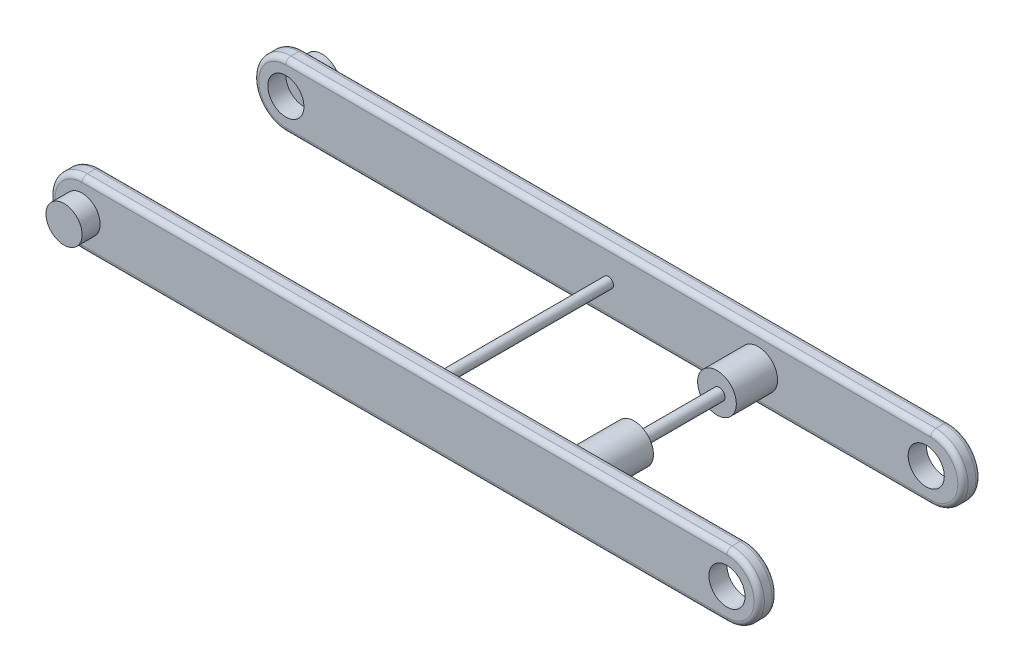
ISO-10303-21;
HEADER;
FILE_DESCRIPTION(('STEP AP214'),'2;1');
FILE_NAME('part.step','',(''),(''),'','','');
FILE_SCHEMA(('AUTOMOTIVE_DESIGN { 1 0 10303 214 1 1 1 1 }'));
ENDSEC;
DATA;
#1=APPLICATION_CONTEXT('core data for automotive mechanical design processes');
#2=APPLICATION_PROTOCOL_DEFINITION('international standard','automotive_design',2000,#1);
#3=PRODUCT_CONTEXT('',#1,'mechanical');
#4=PRODUCT('Part','Part','',(#3));
#5=PRODUCT_RELATED_PRODUCT_CATEGORY('part','',(#4));
#6=PRODUCT_DEFINITION_FORMATION('','',#4);
#7=PRODUCT_DEFINITION_CONTEXT('part definition',#1,'design');
#8=PRODUCT_DEFINITION('design','',#6,#7);
#9=PRODUCT_DEFINITION_SHAPE('','',#8);
#10=(LENGTH_UNIT() NAMED_UNIT(*) SI_UNIT(.MILLI.,.METRE.));
#11=(NAMED_UNIT(*) PLANE_ANGLE_UNIT() SI_UNIT($,.RADIAN.));
#12=(NAMED_UNIT(*) SI_UNIT($,.STERADIAN.) SOLID_ANGLE_UNIT());
#13=UNCERTAINTY_MEASURE_WITH_UNIT(LENGTH_MEASURE(1.E-05),#10,'distance_accuracy_value','');
#14=(GEOMETRIC_REPRESENTATION_CONTEXT(3) GLOBAL_UNCERTAINTY_ASSIGNED_CONTEXT((#13)) GLOBAL_UNIT_ASSIGNED_CONTEXT((#10,
#11,#12)) REPRESENTATION_CONTEXT('',''));
#15=CARTESIAN_POINT('',(0.,0.,0.));
#16=DIRECTION('',(0.,0.,1.));
#17=DIRECTION('',(1.,0.,0.));
#18=AXIS2_PLACEMENT_3D('',#15,#16,#17);
#19=CARTESIAN_POINT('',(-125.,0.,93.));
#20=DIRECTION('',(0.,0.,-1.));
#21=DIRECTION('',(-1.,0.,0.));
#22=AXIS2_PLACEMENT_3D('',#19,#20,#21);
#23=CYLINDRICAL_SURFACE('',#22,7.00000000000001);
#24=CARTESIAN_POINT('',(-125.,0.,93.));
#25=DIRECTION('',(0.,0.,1.));
#26=DIRECTION('',(1.,0.,0.));
#27=AXIS2_PLACEMENT_3D('',#24,#25,#26);
#28=CIRCLE('',#27,7.00000000000001);
#29=CARTESIAN_POINT('',(-118.,0.,93.));
#30=VERTEX_POINT('',#29);
#31=EDGE_CURVE('E11',#30,#30,#28,.T.);
#32=ORIENTED_EDGE('',*,*,#31,.F.);
#33=EDGE_LOOP('',(#32));
#34=FACE_BOUND('',#33,.T.);
#35=CARTESIAN_POINT('',(-125.,0.,86.));
#36=DIRECTION('',(0.,0.,1.));
#37=DIRECTION('',(1.,0.,0.));
#38=AXIS2_PLACEMENT_3D('',#35,#36,#37);
#39=CIRCLE('',#38,7.00000000000001);
#40=CARTESIAN_POINT('',(-118.,0.,86.));
#41=VERTEX_POINT('',#40);
#42=EDGE_CURVE('E43',#41,#41,#39,.T.);
#43=ORIENTED_EDGE('',*,*,#42,.T.);
#44=EDGE_LOOP('',(#43));
#45=FACE_BOUND('',#44,.T.);
#46=ADVANCED_FACE('F40',(#34,#45),#23,.T.);
#47=CARTESIAN_POINT('',(-125.,0.,93.));
#48=DIRECTION('',(0.,0.,1.));
#49=DIRECTION('',(1.,0.,0.));
#50=AXIS2_PLACEMENT_3D('',#47,#48,#49);
#51=PLANE('',#50);
#52=ORIENTED_EDGE('',*,*,#31,.T.);
#53=EDGE_LOOP('',(#52));
#54=FACE_BOUND('',#53,.T.);
#55=ADVANCED_FACE('F55',(#54),#51,.T.);
#56=CARTESIAN_POINT('',(-125.,0.,86.));
#57=DIRECTION('',(0.,0.,1.));
#58=DIRECTION('',(1.,0.,0.));
#59=AXIS2_PLACEMENT_3D('',#56,#57,#58);
#60=PLANE('',#59);
#61=ORIENTED_EDGE('',*,*,#42,.F.);
#62=EDGE_LOOP('',(#61));
#63=FACE_BOUND('',#62,.T.);
#64=ADVANCED_FACE('F53',(#63),#60,.F.);
#65=CLOSED_SHELL('',(#46,#55,#64));
#66=MANIFOLD_SOLID_BREP('B2',#65);
#67=CARTESIAN_POINT('',(59.,0.,82.));
#68=DIRECTION('',(0.,0.,-1.));
#69=DIRECTION('',(-1.,0.,0.));
#70=AXIS2_PLACEMENT_3D('',#67,#68,#69);
#71=CYLINDRICAL_SURFACE('',#70,2.25);
#72=CARTESIAN_POINT('',(59.,0.,56.));
#73=DIRECTION('',(0.,0.,-1.));
#74=DIRECTION('',(-1.,0.,0.));
#75=AXIS2_PLACEMENT_3D('',#72,#73,#74);
#76=CIRCLE('',#75,2.25);
#77=CARTESIAN_POINT('',(56.75,0.,56.));
#78=VERTEX_POINT('',#77);
#79=EDGE_CURVE('E38',#78,#78,#76,.F.);
#80=ORIENTED_EDGE('',*,*,#79,.F.);
#81=EDGE_LOOP('',(#80));
#82=FACE_BOUND('',#81,.T.);
#83=CARTESIAN_POINT('',(59.,0.,23.));
#84=DIRECTION('',(0.,0.,-1.));
#85=DIRECTION('',(-1.,0.,0.));
#86=AXIS2_PLACEMENT_3D('',#83,#84,#85);
#87=CIRCLE('',#86,2.25);
#88=CARTESIAN_POINT('',(56.75,0.,23.));
#89=VERTEX_POINT('',#88);
#90=EDGE_CURVE('E263',#89,#89,#87,.F.);
#91=ORIENTED_EDGE('',*,*,#90,.T.);
#92=EDGE_LOOP('',(#91));
#93=FACE_BOUND('',#92,.T.);
#94=ADVANCED_FACE('F81',(#82,#93),#71,.T.);
#95=CARTESIAN_POINT('',(125.,0.,86.));
#96=DIRECTION('',(0.,0.,-1.));
#97=DIRECTION('',(-1.,0.,0.));
#98=AXIS2_PLACEMENT_3D('',#95,#96,#97);
#99=CYLINDRICAL_SURFACE('',#98,12.5);
#100=DIRECTION('',(0.,0.,-1.));
#101=VECTOR('',#100,1.);
#102=CARTESIAN_POINT('',(125.,12.5,86.));
#103=LINE('',#102,#101);
#104=CARTESIAN_POINT('',(125.,12.5,84.));
#105=VERTEX_POINT('',#104);
#106=CARTESIAN_POINT('',(125.,12.5,81.));
#107=VERTEX_POINT('',#106);
#108=EDGE_CURVE('E292',#105,#107,#103,.T.);
#109=ORIENTED_EDGE('',*,*,#108,.F.);
#110=CARTESIAN_POINT('',(125.,0.,84.));
#111=DIRECTION('',(0.,0.,1.));
#112=DIRECTION('',(1.,0.,0.));
#113=AXIS2_PLACEMENT_3D('',#110,#111,#112);
#114=CIRCLE('',#113,12.5);
#115=CARTESIAN_POINT('',(125.,-12.5,84.));
#116=VERTEX_POINT('',#115);
#117=EDGE_CURVE('E316',#105,#116,#114,.F.);
#118=ORIENTED_EDGE('',*,*,#117,.T.);
#119=DIRECTION('',(0.,0.,-1.));
#120=VECTOR('',#119,1.);
#121=CARTESIAN_POINT('',(125.,-12.5,86.));
#122=LINE('',#121,#120);
#123=CARTESIAN_POINT('',(125.,-12.5,81.));
#124=VERTEX_POINT('',#123);
#125=EDGE_CURVE('E273',#116,#124,#122,.T.);
#126=ORIENTED_EDGE('',*,*,#125,.T.);
#127=CARTESIAN_POINT('',(125.,0.,81.));
#128=DIRECTION('',(0.,0.,1.));
#129=DIRECTION('',(1.,0.,0.));
#130=AXIS2_PLACEMENT_3D('',#127,#128,#129);
#131=CIRCLE('',#130,12.5);
#132=EDGE_CURVE('E313',#124,#107,#131,.T.);
#133=ORIENTED_EDGE('',*,*,#132,.T.);
#134=EDGE_LOOP('',(#109,#118,#126,#133));
#135=FACE_BOUND('',#134,.T.);
#136=ADVANCED_FACE('F462',(#135),#99,.T.);
#137=CARTESIAN_POINT('',(125.,12.5,86.));
#138=DIRECTION('',(0.,-1.,0.));
#139=DIRECTION('',(1.,0.,0.));
#140=AXIS2_PLACEMENT_3D('',#137,#138,#139);
#141=PLANE('',#140);
#142=DIRECTION('',(0.,0.,-1.));
#143=VECTOR('',#142,1.);
#144=CARTESIAN_POINT('',(-125.,12.5,86.));
#145=LINE('',#144,#143);
#146=CARTESIAN_POINT('',(-125.,12.5,84.));
#147=VERTEX_POINT('',#146);
#148=CARTESIAN_POINT('',(-125.,12.5,81.));
#149=VERTEX_POINT('',#148);
#150=EDGE_CURVE('E289',#147,#149,#145,.T.);
#151=ORIENTED_EDGE('',*,*,#150,.F.);
#152=DIRECTION('',(-1.,0.,0.));
#153=VECTOR('',#152,1.);
#154=CARTESIAN_POINT('',(125.,12.5,84.));
#155=LINE('',#154,#153);
#156=EDGE_CURVE('E311',#147,#105,#155,.F.);
#157=ORIENTED_EDGE('',*,*,#156,.T.);
#158=ORIENTED_EDGE('',*,*,#108,.T.);
#159=DIRECTION('',(-1.,0.,0.));
#160=VECTOR('',#159,1.);
#161=CARTESIAN_POINT('',(125.,12.5,81.));
#162=LINE('',#161,#160);
#163=EDGE_CURVE('E309',#107,#149,#162,.T.);
#164=ORIENTED_EDGE('',*,*,#163,.T.);
#165=EDGE_LOOP('',(#151,#157,#158,#164));
#166=FACE_BOUND('',#165,.T.);
#167=ADVANCED_FACE('F470',(#166),#141,.F.);
#168=CARTESIAN_POINT('',(-125.,0.,86.));
#169=DIRECTION('',(0.,0.,-1.));
#170=DIRECTION('',(-1.,0.,0.));
#171=AXIS2_PLACEMENT_3D('',#168,#169,#170);
#172=CYLINDRICAL_SURFACE('',#171,12.5);
#173=DIRECTION('',(0.,0.,-1.));
#174=VECTOR('',#173,1.);
#175=CARTESIAN_POINT('',(-125.,-12.5000000000001,86.));
#176=LINE('',#175,#174);
#177=CARTESIAN_POINT('',(-125.,-12.5000000000001,84.));
#178=VERTEX_POINT('',#177);
#179=CARTESIAN_POINT('',(-125.,-12.5000000000001,81.));
#180=VERTEX_POINT('',#179);
#181=EDGE_CURVE('E286',#178,#180,#176,.T.);
#182=ORIENTED_EDGE('',*,*,#181,.F.);
#183=CARTESIAN_POINT('',(-125.,0.,84.));
#184=DIRECTION('',(0.,0.,1.));
#185=DIRECTION('',(1.,0.,0.));
#186=AXIS2_PLACEMENT_3D('',#183,#184,#185);
#187=CIRCLE('',#186,12.5);
#188=EDGE_CURVE('E306',#178,#147,#187,.F.);
#189=ORIENTED_EDGE('',*,*,#188,.T.);
#190=ORIENTED_EDGE('',*,*,#150,.T.);
#191=CARTESIAN_POINT('',(-125.,0.,81.));
#192=DIRECTION('',(0.,0.,1.));
#193=DIRECTION('',(1.,0.,0.));
#194=AXIS2_PLACEMENT_3D('',#191,#192,#193);
#195=CIRCLE('',#194,12.5);
#196=EDGE_CURVE('E304',#149,#180,#195,.T.);
#197=ORIENTED_EDGE('',*,*,#196,.T.);
#198=EDGE_LOOP('',(#182,#189,#190,#197));
#199=FACE_BOUND('',#198,.T.);
#200=ADVANCED_FACE('F784',(#199),#172,.T.);
#201=CARTESIAN_POINT('',(125.,-12.5,86.));
#202=DIRECTION('',(0.,1.,0.));
#203=DIRECTION('',(-1.,0.,0.));
#204=AXIS2_PLACEMENT_3D('',#201,#202,#203);
#205=PLANE('',#204);
#206=ORIENTED_EDGE('',*,*,#181,.T.);
#207=DIRECTION('',(1.,0.,0.));
#208=VECTOR('',#207,1.);
#209=CARTESIAN_POINT('',(125.,-12.5,81.));
#210=LINE('',#209,#208);
#211=EDGE_CURVE('E327',#180,#124,#210,.T.);
#212=ORIENTED_EDGE('',*,*,#211,.T.);
#213=ORIENTED_EDGE('',*,*,#125,.F.);
#214=DIRECTION('',(1.,0.,0.));
#215=VECTOR('',#214,1.);
#216=CARTESIAN_POINT('',(-125.,-12.5000000000001,84.));
#217=LINE('',#216,#215);
#218=EDGE_CURVE('E325',#116,#178,#217,.F.);
#219=ORIENTED_EDGE('',*,*,#218,.T.);
#220=EDGE_LOOP('',(#206,#212,#213,#219));
#221=FACE_BOUND('',#220,.T.);
#222=ADVANCED_FACE('F780',(#221),#205,.F.);
#223=CARTESIAN_POINT('',(125.,0.,86.));
#224=DIRECTION('',(0.,0.,1.));
#225=DIRECTION('',(1.,0.,0.));
#226=AXIS2_PLACEMENT_3D('',#223,#224,#225);
#227=PLANE('',#226);
#228=DIRECTION('',(-1.,0.,0.));
#229=VECTOR('',#228,1.);
#230=CARTESIAN_POINT('',(-125.,10.4999999999999,86.));
#231=LINE('',#230,#229);
#232=CARTESIAN_POINT('',(125.,10.5,86.));
#233=VERTEX_POINT('',#232);
#234=CARTESIAN_POINT('',(-125.,10.4999999999999,86.));
#235=VERTEX_POINT('',#234);
#236=EDGE_CURVE('E299',#233,#235,#231,.T.);
#237=ORIENTED_EDGE('',*,*,#236,.T.);
#238=CARTESIAN_POINT('',(-125.,0.,86.));
#239=DIRECTION('',(0.,0.,1.));
#240=DIRECTION('',(1.,0.,0.));
#241=AXIS2_PLACEMENT_3D('',#238,#239,#240);
#242=CIRCLE('',#241,10.5);
#243=CARTESIAN_POINT('',(-125.,-10.5000000000001,86.));
#244=VERTEX_POINT('',#243);
#245=EDGE_CURVE('E301',#235,#244,#242,.T.);
#246=ORIENTED_EDGE('',*,*,#245,.T.);
#247=DIRECTION('',(1.,0.,0.));
#248=VECTOR('',#247,1.);
#249=CARTESIAN_POINT('',(125.,-10.5,86.));
#250=LINE('',#249,#248);
#251=CARTESIAN_POINT('',(125.,-10.5,86.));
#252=VERTEX_POINT('',#251);
#253=EDGE_CURVE('E295',#244,#252,#250,.T.);
#254=ORIENTED_EDGE('',*,*,#253,.T.);
#255=CARTESIAN_POINT('',(125.,0.,86.));
#256=DIRECTION('',(0.,0.,1.));
#257=DIRECTION('',(1.,0.,0.));
#258=AXIS2_PLACEMENT_3D('',#255,#256,#257);
#259=CIRCLE('',#258,10.5);
#260=EDGE_CURVE('E297',#252,#233,#259,.T.);
#261=ORIENTED_EDGE('',*,*,#260,.T.);
#262=EDGE_LOOP('',(#237,#246,#254,#261));
#263=FACE_BOUND('',#262,.T.);
#264=CARTESIAN_POINT('',(125.,0.,86.));
#265=DIRECTION('',(0.,0.,1.));
#266=DIRECTION('',(1.,0.,0.));
#267=AXIS2_PLACEMENT_3D('',#264,#265,#266);
#268=CIRCLE('',#267,7.00000000000001);
#269=CARTESIAN_POINT('',(132.,0.,86.));
#270=VERTEX_POINT('',#269);
#271=EDGE_CURVE('E274',#270,#270,#268,.T.);
#272=ORIENTED_EDGE('',*,*,#271,.F.);
#273=EDGE_LOOP('',(#272));
#274=FACE_BOUND('',#273,.T.);
#275=CARTESIAN_POINT('',(-125.,0.,86.));
#276=DIRECTION('',(0.,0.,1.));
#277=DIRECTION('',(1.,0.,0.));
#278=AXIS2_PLACEMENT_3D('',#275,#276,#277);
#279=CIRCLE('',#278,7.);
#280=CARTESIAN_POINT('',(-118.,0.,86.));
#281=VERTEX_POINT('',#280);
#282=EDGE_CURVE('E280',#281,#281,#279,.T.);
#283=ORIENTED_EDGE('',*,*,#282,.F.);
#284=EDGE_LOOP('',(#283));
#285=FACE_BOUND('',#284,.T.);
#286=ADVANCED_FACE('F600',(#263,#274,#285),#227,.T.);
#287=CARTESIAN_POINT('',(125.,0.,79.));
#288=DIRECTION('',(0.,0.,1.));
#289=DIRECTION('',(1.,0.,0.));
#290=AXIS2_PLACEMENT_3D('',#287,#288,#289);
#291=PLANE('',#290);
#292=CARTESIAN_POINT('',(59.,0.,79.));
#293=DIRECTION('',(0.,0.,1.));
#294=DIRECTION('',(1.,0.,0.));
#295=AXIS2_PLACEMENT_3D('',#292,#293,#294);
#296=CIRCLE('',#295,7.5);
#297=CARTESIAN_POINT('',(66.5,0.,79.));
#298=VERTEX_POINT('',#297);
#299=EDGE_CURVE('E89',#298,#298,#296,.F.);
#300=ORIENTED_EDGE('',*,*,#299,.F.);
#301=EDGE_LOOP('',(#300));
#302=FACE_BOUND('',#301,.T.);
#303=CARTESIAN_POINT('',(0.,0.,79.));
#304=DIRECTION('',(0.,0.,1.));
#305=DIRECTION('',(1.,0.,0.));
#306=AXIS2_PLACEMENT_3D('',#303,#304,#305);
#307=CIRCLE('',#306,2.);
#308=CARTESIAN_POINT('',(2.,0.,79.));
#309=VERTEX_POINT('',#308);
#310=EDGE_CURVE('E252',#309,#309,#307,.T.);
#311=ORIENTED_EDGE('',*,*,#310,.T.);
#312=EDGE_LOOP('',(#311));
#313=FACE_BOUND('',#312,.T.);
#314=DIRECTION('',(-1.,0.,0.));
#315=VECTOR('',#314,1.);
#316=CARTESIAN_POINT('',(125.,10.5,79.));
#317=LINE('',#316,#315);
#318=CARTESIAN_POINT('',(-125.,10.4999999999999,79.));
#319=VERTEX_POINT('',#318);
#320=CARTESIAN_POINT('',(125.,10.5,79.));
#321=VERTEX_POINT('',#320);
#322=EDGE_CURVE('E318',#319,#321,#317,.F.);
#323=ORIENTED_EDGE('',*,*,#322,.T.);
#324=CARTESIAN_POINT('',(125.,0.,79.));
#325=DIRECTION('',(0.,0.,1.));
#326=DIRECTION('',(1.,0.,0.));
#327=AXIS2_PLACEMENT_3D('',#324,#325,#326);
#328=CIRCLE('',#327,10.5);
#329=CARTESIAN_POINT('',(125.,-10.5,79.));
#330=VERTEX_POINT('',#329);
#331=EDGE_CURVE('E323',#321,#330,#328,.F.);
#332=ORIENTED_EDGE('',*,*,#331,.T.);
#333=DIRECTION('',(1.,0.,0.));
#334=VECTOR('',#333,1.);
#335=CARTESIAN_POINT('',(125.,-10.5,79.));
#336=LINE('',#335,#334);
#337=CARTESIAN_POINT('',(-125.,-10.5,79.));
#338=VERTEX_POINT('',#337);
#339=EDGE_CURVE('E103',#330,#338,#336,.F.);
#340=ORIENTED_EDGE('',*,*,#339,.T.);
#341=CARTESIAN_POINT('',(-125.,0.,79.));
#342=DIRECTION('',(0.,0.,1.));
#343=DIRECTION('',(1.,0.,0.));
#344=AXIS2_PLACEMENT_3D('',#341,#342,#343);
#345=CIRCLE('',#344,10.5);
#346=EDGE_CURVE('E320',#338,#319,#345,.F.);
#347=ORIENTED_EDGE('',*,*,#346,.T.);
#348=EDGE_LOOP('',(#323,#332,#340,#347));
#349=FACE_BOUND('',#348,.T.);
#350=CARTESIAN_POINT('',(125.,0.,79.));
#351=DIRECTION('',(0.,0.,1.));
#352=DIRECTION('',(1.,0.,0.));
#353=AXIS2_PLACEMENT_3D('',#350,#351,#352);
#354=CIRCLE('',#353,7.00000000000001);
#355=CARTESIAN_POINT('',(132.,0.,79.));
#356=VERTEX_POINT('',#355);
#357=EDGE_CURVE('E270',#356,#356,#354,.T.);
#358=ORIENTED_EDGE('',*,*,#357,.T.);
#359=EDGE_LOOP('',(#358));
#360=FACE_BOUND('',#359,.T.);
#361=CARTESIAN_POINT('',(-125.,0.,79.));
#362=DIRECTION('',(0.,0.,1.));
#363=DIRECTION('',(1.,0.,0.));
#364=AXIS2_PLACEMENT_3D('',#361,#362,#363);
#365=CIRCLE('',#364,7.);
#366=CARTESIAN_POINT('',(-118.,0.,79.));
#367=VERTEX_POINT('',#366);
#368=EDGE_CURVE('E277',#367,#367,#365,.T.);
#369=ORIENTED_EDGE('',*,*,#368,.T.);
#370=EDGE_LOOP('',(#369));
#371=FACE_BOUND('',#370,.T.);
#372=ADVANCED_FACE('F595',(#302,#313,#349,#360,#371),#291,.F.);
#373=CARTESIAN_POINT('',(-125.,0.,79.));
#374=DIRECTION('',(0.,0.,1.));
#375=DIRECTION('',(1.,0.,0.));
#376=AXIS2_PLACEMENT_3D('',#373,#374,#375);
#377=CYLINDRICAL_SURFACE('',#376,7.);
#378=ORIENTED_EDGE('',*,*,#368,.F.);
#379=EDGE_LOOP('',(#378));
#380=FACE_BOUND('',#379,.T.);
#381=ORIENTED_EDGE('',*,*,#282,.T.);
#382=EDGE_LOOP('',(#381));
#383=FACE_BOUND('',#382,.T.);
#384=ADVANCED_FACE('F599',(#380,#383),#377,.F.);
#385=CARTESIAN_POINT('',(125.,0.,79.));
#386=DIRECTION('',(0.,0.,1.));
#387=DIRECTION('',(1.,0.,0.));
#388=AXIS2_PLACEMENT_3D('',#385,#386,#387);
#389=CYLINDRICAL_SURFACE('',#388,7.00000000000001);
#390=ORIENTED_EDGE('',*,*,#357,.F.);
#391=EDGE_LOOP('',(#390));
#392=FACE_BOUND('',#391,.T.);
#393=ORIENTED_EDGE('',*,*,#271,.T.);
#394=EDGE_LOOP('',(#393));
#395=FACE_BOUND('',#394,.T.);
#396=ADVANCED_FACE('F641',(#392,#395),#389,.F.);
#397=CARTESIAN_POINT('',(125.,0.,84.));
#398=DIRECTION('',(0.,0.,1.));
#399=DIRECTION('',(1.,0.,0.));
#400=AXIS2_PLACEMENT_3D('',#397,#398,#399);
#401=TOROIDAL_SURFACE('',#400,10.5,2.);
#402=CARTESIAN_POINT('',(125.,-10.5,84.));
#403=DIRECTION('',(-1.,0.,0.));
#404=DIRECTION('',(0.,0.,1.));
#405=AXIS2_PLACEMENT_3D('',#402,#403,#404);
#406=CIRCLE('',#405,2.);
#407=EDGE_CURVE('E335',#116,#252,#406,.T.);
#408=ORIENTED_EDGE('',*,*,#407,.F.);
#409=ORIENTED_EDGE('',*,*,#117,.F.);
#410=CARTESIAN_POINT('',(125.,10.5,84.));
#411=DIRECTION('',(-1.,0.,0.));
#412=DIRECTION('',(0.,0.,1.));
#413=AXIS2_PLACEMENT_3D('',#410,#411,#412);
#414=CIRCLE('',#413,2.);
#415=EDGE_CURVE('E283',#233,#105,#414,.T.);
#416=ORIENTED_EDGE('',*,*,#415,.F.);
#417=ORIENTED_EDGE('',*,*,#260,.F.);
#418=EDGE_LOOP('',(#408,#409,#416,#417));
#419=FACE_BOUND('',#418,.T.);
#420=ADVANCED_FACE('F648',(#419),#401,.T.);
#421=CARTESIAN_POINT('',(125.,10.5,84.));
#422=DIRECTION('',(1.,0.,0.));
#423=DIRECTION('',(0.,1.,0.));
#424=AXIS2_PLACEMENT_3D('',#421,#422,#423);
#425=CYLINDRICAL_SURFACE('',#424,2.);
#426=ORIENTED_EDGE('',*,*,#415,.T.);
#427=ORIENTED_EDGE('',*,*,#156,.F.);
#428=CARTESIAN_POINT('',(-125.,10.4999999999999,84.));
#429=DIRECTION('',(-1.,0.,0.));
#430=DIRECTION('',(0.,0.,1.));
#431=AXIS2_PLACEMENT_3D('',#428,#429,#430);
#432=CIRCLE('',#431,2.);
#433=EDGE_CURVE('E332',#235,#147,#432,.T.);
#434=ORIENTED_EDGE('',*,*,#433,.F.);
#435=ORIENTED_EDGE('',*,*,#236,.F.);
#436=EDGE_LOOP('',(#426,#427,#434,#435));
#437=FACE_BOUND('',#436,.T.);
#438=ADVANCED_FACE('F657',(#437),#425,.T.);
#439=CARTESIAN_POINT('',(125.,-10.5,84.));
#440=DIRECTION('',(-1.,0.,0.));
#441=DIRECTION('',(0.,-1.,0.));
#442=AXIS2_PLACEMENT_3D('',#439,#440,#441);
#443=CYLINDRICAL_SURFACE('',#442,2.);
#444=ORIENTED_EDGE('',*,*,#407,.T.);
#445=ORIENTED_EDGE('',*,*,#253,.F.);
#446=CARTESIAN_POINT('',(-125.,-10.5000000000001,84.));
#447=DIRECTION('',(-1.,0.,0.));
#448=DIRECTION('',(0.,0.,1.));
#449=AXIS2_PLACEMENT_3D('',#446,#447,#448);
#450=CIRCLE('',#449,2.);
#451=EDGE_CURVE('E330',#178,#244,#450,.T.);
#452=ORIENTED_EDGE('',*,*,#451,.F.);
#453=ORIENTED_EDGE('',*,*,#218,.F.);
#454=EDGE_LOOP('',(#444,#445,#452,#453));
#455=FACE_BOUND('',#454,.T.);
#456=ADVANCED_FACE('F665',(#455),#443,.T.);
#457=CARTESIAN_POINT('',(-125.,0.,84.));
#458=DIRECTION('',(0.,0.,1.));
#459=DIRECTION('',(1.,0.,0.));
#460=AXIS2_PLACEMENT_3D('',#457,#458,#459);
#461=TOROIDAL_SURFACE('',#460,10.5,2.);
#462=ORIENTED_EDGE('',*,*,#433,.T.);
#463=ORIENTED_EDGE('',*,*,#188,.F.);
#464=ORIENTED_EDGE('',*,*,#451,.T.);
#465=ORIENTED_EDGE('',*,*,#245,.F.);
#466=EDGE_LOOP('',(#462,#463,#464,#465));
#467=FACE_BOUND('',#466,.T.);
#468=ADVANCED_FACE('F673',(#467),#461,.T.);
#469=CARTESIAN_POINT('',(-125.,0.,81.));
#470=DIRECTION('',(0.,0.,1.));
#471=DIRECTION('',(1.,0.,0.));
#472=AXIS2_PLACEMENT_3D('',#469,#470,#471);
#473=TOROIDAL_SURFACE('',#472,10.5,2.);
#474=CARTESIAN_POINT('',(-125.,10.5,81.));
#475=DIRECTION('',(1.,0.,0.));
#476=DIRECTION('',(0.,0.,-1.));
#477=AXIS2_PLACEMENT_3D('',#474,#475,#476);
#478=CIRCLE('',#477,2.);
#479=EDGE_CURVE('E343',#319,#149,#478,.T.);
#480=ORIENTED_EDGE('',*,*,#479,.F.);
#481=ORIENTED_EDGE('',*,*,#346,.F.);
#482=CARTESIAN_POINT('',(-125.,-10.5,81.));
#483=DIRECTION('',(1.,0.,0.));
#484=DIRECTION('',(0.,0.,-1.));
#485=AXIS2_PLACEMENT_3D('',#482,#483,#484);
#486=CIRCLE('',#485,2.);
#487=EDGE_CURVE('E333',#180,#338,#486,.T.);
#488=ORIENTED_EDGE('',*,*,#487,.F.);
#489=ORIENTED_EDGE('',*,*,#196,.F.);
#490=EDGE_LOOP('',(#480,#481,#488,#489));
#491=FACE_BOUND('',#490,.T.);
#492=ADVANCED_FACE('F83',(#491),#473,.T.);
#493=CARTESIAN_POINT('',(125.,-10.5,81.));
#494=DIRECTION('',(1.,0.,0.));
#495=DIRECTION('',(0.,1.,0.));
#496=AXIS2_PLACEMENT_3D('',#493,#494,#495);
#497=CYLINDRICAL_SURFACE('',#496,2.);
#498=ORIENTED_EDGE('',*,*,#487,.T.);
#499=ORIENTED_EDGE('',*,*,#339,.F.);
#500=CARTESIAN_POINT('',(125.,-10.5,81.));
#501=DIRECTION('',(1.,0.,0.));
#502=DIRECTION('',(0.,0.,-1.));
#503=AXIS2_PLACEMENT_3D('',#500,#501,#502);
#504=CIRCLE('',#503,2.);
#505=EDGE_CURVE('E96',#124,#330,#504,.T.);
#506=ORIENTED_EDGE('',*,*,#505,.F.);
#507=ORIENTED_EDGE('',*,*,#211,.F.);
#508=EDGE_LOOP('',(#498,#499,#506,#507));
#509=FACE_BOUND('',#508,.T.);
#510=ADVANCED_FACE('F688',(#509),#497,.T.);
#511=CARTESIAN_POINT('',(125.,10.5,81.));
#512=DIRECTION('',(-1.,0.,0.));
#513=DIRECTION('',(0.,-1.,0.));
#514=AXIS2_PLACEMENT_3D('',#511,#512,#513);
#515=CYLINDRICAL_SURFACE('',#514,2.);
#516=ORIENTED_EDGE('',*,*,#479,.T.);
#517=ORIENTED_EDGE('',*,*,#163,.F.);
#518=CARTESIAN_POINT('',(125.,10.5,81.));
#519=DIRECTION('',(1.,0.,0.));
#520=DIRECTION('',(0.,0.,-1.));
#521=AXIS2_PLACEMENT_3D('',#518,#519,#520);
#522=CIRCLE('',#521,2.);
#523=EDGE_CURVE('E340',#321,#107,#522,.T.);
#524=ORIENTED_EDGE('',*,*,#523,.F.);
#525=ORIENTED_EDGE('',*,*,#322,.F.);
#526=EDGE_LOOP('',(#516,#517,#524,#525));
#527=FACE_BOUND('',#526,.T.);
#528=ADVANCED_FACE('F695',(#527),#515,.T.);
#529=CARTESIAN_POINT('',(125.,0.,81.));
#530=DIRECTION('',(0.,0.,1.));
#531=DIRECTION('',(1.,0.,0.));
#532=AXIS2_PLACEMENT_3D('',#529,#530,#531);
#533=TOROIDAL_SURFACE('',#532,10.5,2.);
#534=ORIENTED_EDGE('',*,*,#505,.T.);
#535=ORIENTED_EDGE('',*,*,#331,.F.);
#536=ORIENTED_EDGE('',*,*,#523,.T.);
#537=ORIENTED_EDGE('',*,*,#132,.F.);
#538=EDGE_LOOP('',(#534,#535,#536,#537));
#539=FACE_BOUND('',#538,.T.);
#540=ADVANCED_FACE('F702',(#539),#533,.T.);
#541=CARTESIAN_POINT('',(0.,0.,82.));
#542=DIRECTION('',(0.,0.,-1.));
#543=DIRECTION('',(-1.,0.,0.));
#544=AXIS2_PLACEMENT_3D('',#541,#542,#543);
#545=CYLINDRICAL_SURFACE('',#544,2.);
#546=CARTESIAN_POINT('',(0.,0.,7.00000000000001));
#547=DIRECTION('',(0.,0.,1.));
#548=DIRECTION('',(1.,0.,0.));
#549=AXIS2_PLACEMENT_3D('',#546,#547,#548);
#550=CIRCLE('',#549,2.);
#551=CARTESIAN_POINT('',(2.,0.,7.00000000000001));
#552=VERTEX_POINT('',#551);
#553=EDGE_CURVE('E329',#552,#552,#550,.F.);
#554=ORIENTED_EDGE('',*,*,#553,.F.);
#555=EDGE_LOOP('',(#554));
#556=FACE_BOUND('',#555,.T.);
#557=ORIENTED_EDGE('',*,*,#310,.F.);
#558=EDGE_LOOP('',(#557));
#559=FACE_BOUND('',#558,.T.);
#560=ADVANCED_FACE('F710',(#556,#559),#545,.T.);
#561=CARTESIAN_POINT('',(-125.,0.,7.));
#562=DIRECTION('',(0.,0.,-1.));
#563=DIRECTION('',(-1.,0.,0.));
#564=AXIS2_PLACEMENT_3D('',#561,#562,#563);
#565=CYLINDRICAL_SURFACE('',#564,12.5);
#566=DIRECTION('',(0.,0.,-1.));
#567=VECTOR('',#566,1.);
#568=CARTESIAN_POINT('',(-125.,-12.5,7.));
#569=LINE('',#568,#567);
#570=CARTESIAN_POINT('',(-125.,-12.5,5.));
#571=VERTEX_POINT('',#570);
#572=CARTESIAN_POINT('',(-125.,-12.5,2.));
#573=VERTEX_POINT('',#572);
#574=EDGE_CURVE('E388',#571,#573,#569,.T.);
#575=ORIENTED_EDGE('',*,*,#574,.F.);
#576=CARTESIAN_POINT('',(-125.,0.,5.));
#577=DIRECTION('',(0.,0.,1.));
#578=DIRECTION('',(1.,0.,0.));
#579=AXIS2_PLACEMENT_3D('',#576,#577,#578);
#580=CIRCLE('',#579,12.5);
#581=CARTESIAN_POINT('',(-125.,12.5,5.));
#582=VERTEX_POINT('',#581);
#583=EDGE_CURVE('E238',#571,#582,#580,.F.);
#584=ORIENTED_EDGE('',*,*,#583,.T.);
#585=DIRECTION('',(0.,0.,-1.));
#586=VECTOR('',#585,1.);
#587=CARTESIAN_POINT('',(-125.,12.5,7.));
#588=LINE('',#587,#586);
#589=CARTESIAN_POINT('',(-125.,12.5,2.));
#590=VERTEX_POINT('',#589);
#591=EDGE_CURVE('E377',#582,#590,#588,.T.);
#592=ORIENTED_EDGE('',*,*,#591,.T.);
#593=CARTESIAN_POINT('',(-125.,0.,2.));
#594=DIRECTION('',(0.,0.,1.));
#595=DIRECTION('',(1.,0.,0.));
#596=AXIS2_PLACEMENT_3D('',#593,#594,#595);
#597=CIRCLE('',#596,12.5);
#598=EDGE_CURVE('E236',#590,#573,#597,.T.);
#599=ORIENTED_EDGE('',*,*,#598,.T.);
#600=EDGE_LOOP('',(#575,#584,#592,#599));
#601=FACE_BOUND('',#600,.T.);
#602=ADVANCED_FACE('F423',(#601),#565,.T.);
#603=CARTESIAN_POINT('',(-125.,-12.5,7.));
#604=DIRECTION('',(0.,1.,0.));
#605=DIRECTION('',(0.,0.,1.));
#606=AXIS2_PLACEMENT_3D('',#603,#604,#605);
#607=PLANE('',#606);
#608=DIRECTION('',(0.,0.,-1.));
#609=VECTOR('',#608,1.);
#610=CARTESIAN_POINT('',(125.,-12.5,7.));
#611=LINE('',#610,#609);
#612=CARTESIAN_POINT('',(125.,-12.5,5.));
#613=VERTEX_POINT('',#612);
#614=CARTESIAN_POINT('',(125.,-12.5,2.));
#615=VERTEX_POINT('',#614);
#616=EDGE_CURVE('E385',#613,#615,#611,.T.);
#617=ORIENTED_EDGE('',*,*,#616,.F.);
#618=DIRECTION('',(1.,0.,0.));
#619=VECTOR('',#618,1.);
#620=CARTESIAN_POINT('',(-125.,-12.5,5.));
#621=LINE('',#620,#619);
#622=EDGE_CURVE('E234',#613,#571,#621,.F.);
#623=ORIENTED_EDGE('',*,*,#622,.T.);
#624=ORIENTED_EDGE('',*,*,#574,.T.);
#625=DIRECTION('',(1.,0.,0.));
#626=VECTOR('',#625,1.);
#627=CARTESIAN_POINT('',(-125.,-12.5,2.));
#628=LINE('',#627,#626);
#629=EDGE_CURVE('E232',#573,#615,#628,.T.);
#630=ORIENTED_EDGE('',*,*,#629,.T.);
#631=EDGE_LOOP('',(#617,#623,#624,#630));
#632=FACE_BOUND('',#631,.T.);
#633=ADVANCED_FACE('F406',(#632),#607,.F.);
#634=CARTESIAN_POINT('',(125.,0.,7.));
#635=DIRECTION('',(0.,0.,-1.));
#636=DIRECTION('',(-1.,0.,0.));
#637=AXIS2_PLACEMENT_3D('',#634,#635,#636);
#638=CYLINDRICAL_SURFACE('',#637,12.5);
#639=DIRECTION('',(0.,0.,-1.));
#640=VECTOR('',#639,1.);
#641=CARTESIAN_POINT('',(125.,12.5,7.));
#642=LINE('',#641,#640);
#643=CARTESIAN_POINT('',(125.,12.5,5.));
#644=VERTEX_POINT('',#643);
#645=CARTESIAN_POINT('',(125.,12.5,2.));
#646=VERTEX_POINT('',#645);
#647=EDGE_CURVE('E382',#644,#646,#642,.T.);
#648=ORIENTED_EDGE('',*,*,#647,.F.);
#649=CARTESIAN_POINT('',(125.,0.,5.));
#650=DIRECTION('',(0.,0.,1.));
#651=DIRECTION('',(1.,0.,0.));
#652=AXIS2_PLACEMENT_3D('',#649,#650,#651);
#653=CIRCLE('',#652,12.5);
#654=EDGE_CURVE('E203',#644,#613,#653,.F.);
#655=ORIENTED_EDGE('',*,*,#654,.T.);
#656=ORIENTED_EDGE('',*,*,#616,.T.);
#657=CARTESIAN_POINT('',(125.,0.,2.));
#658=DIRECTION('',(0.,0.,1.));
#659=DIRECTION('',(1.,0.,0.));
#660=AXIS2_PLACEMENT_3D('',#657,#658,#659);
#661=CIRCLE('',#660,12.5);
#662=EDGE_CURVE('E224',#615,#646,#661,.T.);
#663=ORIENTED_EDGE('',*,*,#662,.T.);
#664=EDGE_LOOP('',(#648,#655,#656,#663));
#665=FACE_BOUND('',#664,.T.);
#666=ADVANCED_FACE('F404',(#665),#638,.T.);
#667=CARTESIAN_POINT('',(-125.,12.5,7.));
#668=DIRECTION('',(0.,-1.,0.));
#669=DIRECTION('',(0.,0.,-1.));
#670=AXIS2_PLACEMENT_3D('',#667,#668,#669);
#671=PLANE('',#670);
#672=ORIENTED_EDGE('',*,*,#591,.F.);
#673=DIRECTION('',(-1.,0.,0.));
#674=VECTOR('',#673,1.);
#675=CARTESIAN_POINT('',(125.,12.5,5.));
#676=LINE('',#675,#674);
#677=EDGE_CURVE('E251',#582,#644,#676,.F.);
#678=ORIENTED_EDGE('',*,*,#677,.T.);
#679=ORIENTED_EDGE('',*,*,#647,.T.);
#680=DIRECTION('',(-1.,0.,0.));
#681=VECTOR('',#680,1.);
#682=CARTESIAN_POINT('',(-125.,12.5,2.));
#683=LINE('',#682,#681);
#684=EDGE_CURVE('E249',#646,#590,#683,.T.);
#685=ORIENTED_EDGE('',*,*,#684,.T.);
#686=EDGE_LOOP('',(#672,#678,#679,#685));
#687=FACE_BOUND('',#686,.T.);
#688=ADVANCED_FACE('F420',(#687),#671,.F.);
#689=CARTESIAN_POINT('',(-125.,0.,7.));
#690=DIRECTION('',(0.,0.,1.));
#691=DIRECTION('',(1.,0.,0.));
#692=AXIS2_PLACEMENT_3D('',#689,#690,#691);
#693=PLANE('',#692);
#694=CARTESIAN_POINT('',(58.1254944472772,0.,7.));
#695=DIRECTION('',(0.,0.,1.));
#696=DIRECTION('',(1.,0.,0.));
#697=AXIS2_PLACEMENT_3D('',#694,#695,#696);
#698=CIRCLE('',#697,7.5);
#699=CARTESIAN_POINT('',(65.6254944472772,0.,7.));
#700=VERTEX_POINT('',#699);
#701=EDGE_CURVE('E352',#700,#700,#698,.T.);
#702=ORIENTED_EDGE('',*,*,#701,.F.);
#703=EDGE_LOOP('',(#702));
#704=FACE_BOUND('',#703,.T.);
#705=ORIENTED_EDGE('',*,*,#553,.T.);
#706=EDGE_LOOP('',(#705));
#707=FACE_BOUND('',#706,.T.);
#708=DIRECTION('',(1.,0.,0.));
#709=VECTOR('',#708,1.);
#710=CARTESIAN_POINT('',(125.,-10.5,7.));
#711=LINE('',#710,#709);
#712=CARTESIAN_POINT('',(-125.,-10.5,7.));
#713=VERTEX_POINT('',#712);
#714=CARTESIAN_POINT('',(125.,-10.5,7.));
#715=VERTEX_POINT('',#714);
#716=EDGE_CURVE('E222',#713,#715,#711,.T.);
#717=ORIENTED_EDGE('',*,*,#716,.T.);
#718=CARTESIAN_POINT('',(125.,0.,7.));
#719=DIRECTION('',(0.,0.,1.));
#720=DIRECTION('',(1.,0.,0.));
#721=AXIS2_PLACEMENT_3D('',#718,#719,#720);
#722=CIRCLE('',#721,10.5);
#723=CARTESIAN_POINT('',(125.,10.5,7.));
#724=VERTEX_POINT('',#723);
#725=EDGE_CURVE('E201',#715,#724,#722,.T.);
#726=ORIENTED_EDGE('',*,*,#725,.T.);
#727=DIRECTION('',(-1.,0.,0.));
#728=VECTOR('',#727,1.);
#729=CARTESIAN_POINT('',(-125.,10.5,7.));
#730=LINE('',#729,#728);
#731=CARTESIAN_POINT('',(-125.,10.5,7.));
#732=VERTEX_POINT('',#731);
#733=EDGE_CURVE('E210',#724,#732,#730,.T.);
#734=ORIENTED_EDGE('',*,*,#733,.T.);
#735=CARTESIAN_POINT('',(-125.,0.,7.));
#736=DIRECTION('',(0.,0.,1.));
#737=DIRECTION('',(1.,0.,0.));
#738=AXIS2_PLACEMENT_3D('',#735,#736,#737);
#739=CIRCLE('',#738,10.5);
#740=EDGE_CURVE('E216',#732,#713,#739,.T.);
#741=ORIENTED_EDGE('',*,*,#740,.T.);
#742=EDGE_LOOP('',(#717,#726,#734,#741));
#743=FACE_BOUND('',#742,.T.);
#744=CARTESIAN_POINT('',(123.250988894554,0.,7.));
#745=DIRECTION('',(0.,0.,1.));
#746=DIRECTION('',(1.,0.,0.));
#747=AXIS2_PLACEMENT_3D('',#744,#745,#746);
#748=CIRCLE('',#747,7.00000000000001);
#749=CARTESIAN_POINT('',(130.250988894554,0.,7.));
#750=VERTEX_POINT('',#749);
#751=EDGE_CURVE('E367',#750,#750,#748,.T.);
#752=ORIENTED_EDGE('',*,*,#751,.F.);
#753=EDGE_LOOP('',(#752));
#754=FACE_BOUND('',#753,.T.);
#755=CARTESIAN_POINT('',(-125.,0.,7.));
#756=DIRECTION('',(0.,0.,1.));
#757=DIRECTION('',(1.,0.,0.));
#758=AXIS2_PLACEMENT_3D('',#755,#756,#757);
#759=CIRCLE('',#758,7.);
#760=CARTESIAN_POINT('',(-118.,0.,7.));
#761=VERTEX_POINT('',#760);
#762=EDGE_CURVE('E371',#761,#761,#759,.T.);
#763=ORIENTED_EDGE('',*,*,#762,.F.);
#764=EDGE_LOOP('',(#763));
#765=FACE_BOUND('',#764,.T.);
#766=ADVANCED_FACE('F219',(#704,#707,#743,#754,#765),#693,.T.);
#767=CARTESIAN_POINT('',(-125.,0.,0.));
#768=DIRECTION('',(0.,0.,1.));
#769=DIRECTION('',(1.,0.,0.));
#770=AXIS2_PLACEMENT_3D('',#767,#768,#769);
#771=CYLINDRICAL_SURFACE('',#770,7.);
#772=CARTESIAN_POINT('',(-125.,0.,0.));
#773=DIRECTION('',(0.,0.,1.));
#774=DIRECTION('',(1.,0.,0.));
#775=AXIS2_PLACEMENT_3D('',#772,#773,#774);
#776=CIRCLE('',#775,7.);
#777=CARTESIAN_POINT('',(-118.,0.,0.));
#778=VERTEX_POINT('',#777);
#779=EDGE_CURVE('E374',#778,#778,#776,.T.);
#780=ORIENTED_EDGE('',*,*,#779,.F.);
#781=EDGE_LOOP('',(#780));
#782=FACE_BOUND('',#781,.T.);
#783=ORIENTED_EDGE('',*,*,#762,.T.);
#784=EDGE_LOOP('',(#783));
#785=FACE_BOUND('',#784,.T.);
#786=ADVANCED_FACE('F445',(#782,#785),#771,.F.);
#787=CARTESIAN_POINT('',(123.250988894554,0.,0.));
#788=DIRECTION('',(0.,0.,1.));
#789=DIRECTION('',(1.,0.,0.));
#790=AXIS2_PLACEMENT_3D('',#787,#788,#789);
#791=CYLINDRICAL_SURFACE('',#790,7.00000000000001);
#792=CARTESIAN_POINT('',(123.250988894554,0.,0.));
#793=DIRECTION('',(0.,0.,1.));
#794=DIRECTION('',(1.,0.,0.));
#795=AXIS2_PLACEMENT_3D('',#792,#793,#794);
#796=CIRCLE('',#795,7.00000000000001);
#797=CARTESIAN_POINT('',(130.250988894554,0.,0.));
#798=VERTEX_POINT('',#797);
#799=EDGE_CURVE('E368',#798,#798,#796,.T.);
#800=ORIENTED_EDGE('',*,*,#799,.F.);
#801=EDGE_LOOP('',(#800));
#802=FACE_BOUND('',#801,.T.);
#803=ORIENTED_EDGE('',*,*,#751,.T.);
#804=EDGE_LOOP('',(#803));
#805=FACE_BOUND('',#804,.T.);
#806=ADVANCED_FACE('F441',(#802,#805),#791,.F.);
#807=CARTESIAN_POINT('',(-125.,0.,0.));
#808=DIRECTION('',(0.,0.,-1.));
#809=DIRECTION('',(-1.,0.,0.));
#810=AXIS2_PLACEMENT_3D('',#807,#808,#809);
#811=PLANE('',#810);
#812=ORIENTED_EDGE('',*,*,#779,.T.);
#813=EDGE_LOOP('',(#812));
#814=FACE_BOUND('',#813,.T.);
#815=ADVANCED_FACE('F444',(#814),#811,.F.);
#816=CARTESIAN_POINT('',(-125.,0.,-7.));
#817=DIRECTION('',(0.,0.,1.));
#818=DIRECTION('',(1.,0.,0.));
#819=AXIS2_PLACEMENT_3D('',#816,#817,#818);
#820=CYLINDRICAL_SURFACE('',#819,7.21207685977665);
#821=CARTESIAN_POINT('',(-125.,0.,-7.));
#822=DIRECTION('',(0.,0.,-1.));
#823=DIRECTION('',(-1.,0.,0.));
#824=AXIS2_PLACEMENT_3D('',#821,#822,#823);
#825=CIRCLE('',#824,7.21207685977665);
#826=CARTESIAN_POINT('',(-132.212076859777,0.,-7.));
#827=VERTEX_POINT('',#826);
#828=EDGE_CURVE('E259',#827,#827,#825,.T.);
#829=ORIENTED_EDGE('',*,*,#828,.F.);
#830=EDGE_LOOP('',(#829));
#831=FACE_BOUND('',#830,.T.);
#832=CARTESIAN_POINT('',(-125.,0.,0.));
#833=DIRECTION('',(0.,0.,1.));
#834=DIRECTION('',(1.,0.,0.));
#835=AXIS2_PLACEMENT_3D('',#832,#833,#834);
#836=CIRCLE('',#835,7.21207685977665);
#837=CARTESIAN_POINT('',(-117.787923140223,0.,0.));
#838=VERTEX_POINT('',#837);
#839=EDGE_CURVE('E217',#838,#838,#836,.F.);
#840=ORIENTED_EDGE('',*,*,#839,.T.);
#841=EDGE_LOOP('',(#840));
#842=FACE_BOUND('',#841,.T.);
#843=ADVANCED_FACE('F481',(#831,#842),#820,.T.);
#844=CARTESIAN_POINT('',(-125.,0.,-7.));
#845=DIRECTION('',(0.,0.,-1.));
#846=DIRECTION('',(-1.,0.,0.));
#847=AXIS2_PLACEMENT_3D('',#844,#845,#846);
#848=PLANE('',#847);
#849=ORIENTED_EDGE('',*,*,#828,.T.);
#850=EDGE_LOOP('',(#849));
#851=FACE_BOUND('',#850,.T.);
#852=ADVANCED_FACE('F478',(#851),#848,.T.);
#853=CARTESIAN_POINT('',(-125.,0.,5.));
#854=DIRECTION('',(0.,0.,1.));
#855=DIRECTION('',(1.,0.,0.));
#856=AXIS2_PLACEMENT_3D('',#853,#854,#855);
#857=TOROIDAL_SURFACE('',#856,10.5,2.);
#858=CARTESIAN_POINT('',(-125.,10.5,5.));
#859=DIRECTION('',(1.,0.,0.));
#860=DIRECTION('',(0.,0.,-1.));
#861=AXIS2_PLACEMENT_3D('',#858,#859,#860);
#862=CIRCLE('',#861,2.);
#863=EDGE_CURVE('E213',#582,#732,#862,.T.);
#864=ORIENTED_EDGE('',*,*,#863,.F.);
#865=ORIENTED_EDGE('',*,*,#583,.F.);
#866=CARTESIAN_POINT('',(-125.,-10.5,5.));
#867=DIRECTION('',(1.,0.,0.));
#868=DIRECTION('',(0.,0.,-1.));
#869=AXIS2_PLACEMENT_3D('',#866,#867,#868);
#870=CIRCLE('',#869,2.);
#871=EDGE_CURVE('E256',#713,#571,#870,.T.);
#872=ORIENTED_EDGE('',*,*,#871,.F.);
#873=ORIENTED_EDGE('',*,*,#740,.F.);
#874=EDGE_LOOP('',(#864,#865,#872,#873));
#875=FACE_BOUND('',#874,.T.);
#876=ADVANCED_FACE('F395',(#875),#857,.T.);
#877=CARTESIAN_POINT('',(-125.,-10.5,5.));
#878=DIRECTION('',(-1.,0.,0.));
#879=DIRECTION('',(0.,0.,1.));
#880=AXIS2_PLACEMENT_3D('',#877,#878,#879);
#881=CYLINDRICAL_SURFACE('',#880,2.);
#882=ORIENTED_EDGE('',*,*,#871,.T.);
#883=ORIENTED_EDGE('',*,*,#622,.F.);
#884=CARTESIAN_POINT('',(125.,-10.5,5.));
#885=DIRECTION('',(1.,0.,0.));
#886=DIRECTION('',(0.,0.,-1.));
#887=AXIS2_PLACEMENT_3D('',#884,#885,#886);
#888=CIRCLE('',#887,2.);
#889=EDGE_CURVE('E206',#715,#613,#888,.T.);
#890=ORIENTED_EDGE('',*,*,#889,.F.);
#891=ORIENTED_EDGE('',*,*,#716,.F.);
#892=EDGE_LOOP('',(#882,#883,#890,#891));
#893=FACE_BOUND('',#892,.T.);
#894=ADVANCED_FACE('F398',(#893),#881,.T.);
#895=CARTESIAN_POINT('',(-125.,10.5,5.));
#896=DIRECTION('',(1.,0.,0.));
#897=DIRECTION('',(0.,0.,-1.));
#898=AXIS2_PLACEMENT_3D('',#895,#896,#897);
#899=CYLINDRICAL_SURFACE('',#898,2.);
#900=ORIENTED_EDGE('',*,*,#863,.T.);
#901=ORIENTED_EDGE('',*,*,#733,.F.);
#902=CARTESIAN_POINT('',(125.,10.5,5.));
#903=DIRECTION('',(1.,0.,0.));
#904=DIRECTION('',(0.,0.,-1.));
#905=AXIS2_PLACEMENT_3D('',#902,#903,#904);
#906=CIRCLE('',#905,2.);
#907=EDGE_CURVE('E197',#644,#724,#906,.T.);
#908=ORIENTED_EDGE('',*,*,#907,.F.);
#909=ORIENTED_EDGE('',*,*,#677,.F.);
#910=EDGE_LOOP('',(#900,#901,#908,#909));
#911=FACE_BOUND('',#910,.T.);
#912=ADVANCED_FACE('F211',(#911),#899,.T.);
#913=CARTESIAN_POINT('',(125.,0.,5.));
#914=DIRECTION('',(0.,0.,1.));
#915=DIRECTION('',(1.,0.,0.));
#916=AXIS2_PLACEMENT_3D('',#913,#914,#915);
#917=TOROIDAL_SURFACE('',#916,10.5,2.);
#918=ORIENTED_EDGE('',*,*,#889,.T.);
#919=ORIENTED_EDGE('',*,*,#654,.F.);
#920=ORIENTED_EDGE('',*,*,#907,.T.);
#921=ORIENTED_EDGE('',*,*,#725,.F.);
#922=EDGE_LOOP('',(#918,#919,#920,#921));
#923=FACE_BOUND('',#922,.T.);
#924=ADVANCED_FACE('F199',(#923),#917,.T.);
#925=CARTESIAN_POINT('',(-125.,0.,2.));
#926=DIRECTION('',(0.,0.,1.));
#927=DIRECTION('',(1.,0.,0.));
#928=AXIS2_PLACEMENT_3D('',#925,#926,#927);
#929=TOROIDAL_SURFACE('',#928,10.5,2.);
#930=CARTESIAN_POINT('',(-125.,10.5,2.));
#931=DIRECTION('',(1.,0.,0.));
#932=DIRECTION('',(0.,0.,-1.));
#933=AXIS2_PLACEMENT_3D('',#930,#931,#932);
#934=CIRCLE('',#933,2.);
#935=CARTESIAN_POINT('',(-125.,10.5,0.));
#936=VERTEX_POINT('',#935);
#937=EDGE_CURVE('E265',#936,#590,#934,.T.);
#938=ORIENTED_EDGE('',*,*,#937,.F.);
#939=CARTESIAN_POINT('',(-125.,0.,0.));
#940=DIRECTION('',(0.,0.,1.));
#941=DIRECTION('',(1.,0.,0.));
#942=AXIS2_PLACEMENT_3D('',#939,#940,#941);
#943=CIRCLE('',#942,10.5);
#944=CARTESIAN_POINT('',(-125.,-10.5,0.));
#945=VERTEX_POINT('',#944);
#946=EDGE_CURVE('E242',#945,#936,#943,.F.);
#947=ORIENTED_EDGE('',*,*,#946,.F.);
#948=CARTESIAN_POINT('',(-125.,-10.5,2.));
#949=DIRECTION('',(1.,0.,0.));
#950=DIRECTION('',(0.,0.,-1.));
#951=AXIS2_PLACEMENT_3D('',#948,#949,#950);
#952=CIRCLE('',#951,2.);
#953=EDGE_CURVE('E207',#573,#945,#952,.T.);
#954=ORIENTED_EDGE('',*,*,#953,.F.);
#955=ORIENTED_EDGE('',*,*,#598,.F.);
#956=EDGE_LOOP('',(#938,#947,#954,#955));
#957=FACE_BOUND('',#956,.T.);
#958=ADVANCED_FACE('F426',(#957),#929,.T.);
#959=CARTESIAN_POINT('',(-125.,-10.5,2.));
#960=DIRECTION('',(1.,0.,0.));
#961=DIRECTION('',(0.,0.,-1.));
#962=AXIS2_PLACEMENT_3D('',#959,#960,#961);
#963=CYLINDRICAL_SURFACE('',#962,2.);
#964=ORIENTED_EDGE('',*,*,#953,.T.);
#965=DIRECTION('',(1.,0.,0.));
#966=VECTOR('',#965,1.);
#967=CARTESIAN_POINT('',(-125.,-10.5,0.));
#968=LINE('',#967,#966);
#969=CARTESIAN_POINT('',(125.,-10.5,0.));
#970=VERTEX_POINT('',#969);
#971=EDGE_CURVE('E244',#970,#945,#968,.F.);
#972=ORIENTED_EDGE('',*,*,#971,.F.);
#973=CARTESIAN_POINT('',(125.,-10.5,2.));
#974=DIRECTION('',(1.,0.,0.));
#975=DIRECTION('',(0.,0.,-1.));
#976=AXIS2_PLACEMENT_3D('',#973,#974,#975);
#977=CIRCLE('',#976,2.);
#978=EDGE_CURVE('E262',#615,#970,#977,.T.);
#979=ORIENTED_EDGE('',*,*,#978,.F.);
#980=ORIENTED_EDGE('',*,*,#629,.F.);
#981=EDGE_LOOP('',(#964,#972,#979,#980));
#982=FACE_BOUND('',#981,.T.);
#983=ADVANCED_FACE('F410',(#982),#963,.T.);
#984=CARTESIAN_POINT('',(-125.,10.5,2.));
#985=DIRECTION('',(-1.,0.,0.));
#986=DIRECTION('',(0.,0.,1.));
#987=AXIS2_PLACEMENT_3D('',#984,#985,#986);
#988=CYLINDRICAL_SURFACE('',#987,2.);
#989=ORIENTED_EDGE('',*,*,#937,.T.);
#990=ORIENTED_EDGE('',*,*,#684,.F.);
#991=CARTESIAN_POINT('',(125.,10.5,2.));
#992=DIRECTION('',(1.,0.,0.));
#993=DIRECTION('',(0.,0.,-1.));
#994=AXIS2_PLACEMENT_3D('',#991,#992,#993);
#995=CIRCLE('',#994,2.);
#996=CARTESIAN_POINT('',(125.,10.5,0.));
#997=VERTEX_POINT('',#996);
#998=EDGE_CURVE('E260',#997,#646,#995,.T.);
#999=ORIENTED_EDGE('',*,*,#998,.F.);
#1000=DIRECTION('',(-1.,0.,0.));
#1001=VECTOR('',#1000,1.);
#1002=CARTESIAN_POINT('',(-125.,10.5,0.));
#1003=LINE('',#1002,#1001);
#1004=EDGE_CURVE('E240',#936,#997,#1003,.F.);
#1005=ORIENTED_EDGE('',*,*,#1004,.F.);
#1006=EDGE_LOOP('',(#989,#990,#999,#1005));
#1007=FACE_BOUND('',#1006,.T.);
#1008=ADVANCED_FACE('F430',(#1007),#988,.T.);
#1009=CARTESIAN_POINT('',(125.,0.,2.));
#1010=DIRECTION('',(0.,0.,1.));
#1011=DIRECTION('',(1.,0.,0.));
#1012=AXIS2_PLACEMENT_3D('',#1009,#1010,#1011);
#1013=TOROIDAL_SURFACE('',#1012,10.5,2.);
#1014=ORIENTED_EDGE('',*,*,#978,.T.);
#1015=CARTESIAN_POINT('',(125.,0.,0.));
#1016=DIRECTION('',(0.,0.,1.));
#1017=DIRECTION('',(1.,0.,0.));
#1018=AXIS2_PLACEMENT_3D('',#1015,#1016,#1017);
#1019=CIRCLE('',#1018,10.5);
#1020=EDGE_CURVE('E246',#997,#970,#1019,.F.);
#1021=ORIENTED_EDGE('',*,*,#1020,.F.);
#1022=ORIENTED_EDGE('',*,*,#998,.T.);
#1023=ORIENTED_EDGE('',*,*,#662,.F.);
#1024=EDGE_LOOP('',(#1014,#1021,#1022,#1023));
#1025=FACE_BOUND('',#1024,.T.);
#1026=ADVANCED_FACE('F415',(#1025),#1013,.T.);
#1027=CARTESIAN_POINT('',(0.,0.,0.));
#1028=DIRECTION('',(0.,0.,-1.));
#1029=DIRECTION('',(-1.,0.,0.));
#1030=AXIS2_PLACEMENT_3D('',#1027,#1028,#1029);
#1031=PLANE('',#1030);
#1032=ORIENTED_EDGE('',*,*,#1004,.T.);
#1033=ORIENTED_EDGE('',*,*,#1020,.T.);
#1034=ORIENTED_EDGE('',*,*,#971,.T.);
#1035=ORIENTED_EDGE('',*,*,#946,.T.);
#1036=EDGE_LOOP('',(#1032,#1033,#1034,#1035));
#1037=FACE_BOUND('',#1036,.T.);
#1038=ORIENTED_EDGE('',*,*,#839,.F.);
#1039=EDGE_LOOP('',(#1038));
#1040=FACE_BOUND('',#1039,.T.);
#1041=ORIENTED_EDGE('',*,*,#799,.T.);
#1042=EDGE_LOOP('',(#1041));
#1043=FACE_BOUND('',#1042,.T.);
#1044=ADVANCED_FACE('F432',(#1037,#1040,#1043),#1031,.T.);
#1045=CARTESIAN_POINT('',(58.1254944472772,0.,23.));
#1046=DIRECTION('',(0.,0.,-1.));
#1047=DIRECTION('',(-1.,0.,0.));
#1048=AXIS2_PLACEMENT_3D('',#1045,#1046,#1047);
#1049=CYLINDRICAL_SURFACE('',#1048,7.5);
#1050=ORIENTED_EDGE('',*,*,#701,.T.);
#1051=EDGE_LOOP('',(#1050));
#1052=FACE_BOUND('',#1051,.T.);
#1053=CARTESIAN_POINT('',(58.1254944472772,0.,23.));
#1054=DIRECTION('',(0.,0.,-1.));
#1055=DIRECTION('',(-1.,0.,0.));
#1056=AXIS2_PLACEMENT_3D('',#1053,#1054,#1055);
#1057=CIRCLE('',#1056,7.5);
#1058=CARTESIAN_POINT('',(50.6254944472772,0.,23.));
#1059=VERTEX_POINT('',#1058);
#1060=EDGE_CURVE('E354',#1059,#1059,#1057,.T.);
#1061=ORIENTED_EDGE('',*,*,#1060,.T.);
#1062=EDGE_LOOP('',(#1061));
#1063=FACE_BOUND('',#1062,.T.);
#1064=ADVANCED_FACE('F435',(#1052,#1063),#1049,.T.);
#1065=CARTESIAN_POINT('',(58.1254944472772,0.,23.));
#1066=DIRECTION('',(0.,0.,-1.));
#1067=DIRECTION('',(-1.,0.,0.));
#1068=AXIS2_PLACEMENT_3D('',#1065,#1066,#1067);
#1069=PLANE('',#1068);
#1070=ORIENTED_EDGE('',*,*,#90,.F.);
#1071=EDGE_LOOP('',(#1070));
#1072=FACE_BOUND('',#1071,.T.);
#1073=ORIENTED_EDGE('',*,*,#1060,.F.);
#1074=EDGE_LOOP('',(#1073));
#1075=FACE_BOUND('',#1074,.T.);
#1076=ADVANCED_FACE('F577',(#1072,#1075),#1069,.F.);
#1077=CARTESIAN_POINT('',(59.,0.,56.));
#1078=DIRECTION('',(0.,0.,1.));
#1079=DIRECTION('',(1.,0.,0.));
#1080=AXIS2_PLACEMENT_3D('',#1077,#1078,#1079);
#1081=CYLINDRICAL_SURFACE('',#1080,7.5);
#1082=CARTESIAN_POINT('',(59.,0.,56.));
#1083=DIRECTION('',(0.,0.,-1.));
#1084=DIRECTION('',(-1.,0.,0.));
#1085=AXIS2_PLACEMENT_3D('',#1082,#1083,#1084);
#1086=CIRCLE('',#1085,7.5);
#1087=CARTESIAN_POINT('',(51.5,0.,56.));
#1088=VERTEX_POINT('',#1087);
#1089=EDGE_CURVE('E626',#1088,#1088,#1086,.T.);
#1090=ORIENTED_EDGE('',*,*,#1089,.F.);
#1091=EDGE_LOOP('',(#1090));
#1092=FACE_BOUND('',#1091,.T.);
#1093=ORIENTED_EDGE('',*,*,#299,.T.);
#1094=EDGE_LOOP('',(#1093));
#1095=FACE_BOUND('',#1094,.T.);
#1096=ADVANCED_FACE('F584',(#1092,#1095),#1081,.T.);
#1097=CARTESIAN_POINT('',(59.,0.,56.));
#1098=DIRECTION('',(0.,0.,-1.));
#1099=DIRECTION('',(-1.,0.,0.));
#1100=AXIS2_PLACEMENT_3D('',#1097,#1098,#1099);
#1101=PLANE('',#1100);
#1102=ORIENTED_EDGE('',*,*,#79,.T.);
#1103=EDGE_LOOP('',(#1102));
#1104=FACE_BOUND('',#1103,.T.);
#1105=ORIENTED_EDGE('',*,*,#1089,.T.);
#1106=EDGE_LOOP('',(#1105));
#1107=FACE_BOUND('',#1106,.T.);
#1108=ADVANCED_FACE('F609',(#1104,#1107),#1101,.T.);
#1109=CLOSED_SHELL('',(#94,#136,#167,#200,#222,#286,#372,#384,#396,#420,#438,#456,#468,#492,
#510,#528,#540,#560,#602,#633,#666,#688,#766,#786,#806,#815,#843,#852,#876,#894,#912,#924,#958,
#983,#1008,#1026,#1044,#1064,#1076,#1096,#1108));
#1110=MANIFOLD_SOLID_BREP('B6',#1109);
#1111=ADVANCED_BREP_SHAPE_REPRESENTATION('',(#18,#66,#1110),#14);
#1112=SHAPE_DEFINITION_REPRESENTATION(#9,#1111);
ENDSEC;
END-ISO-10303-21;
